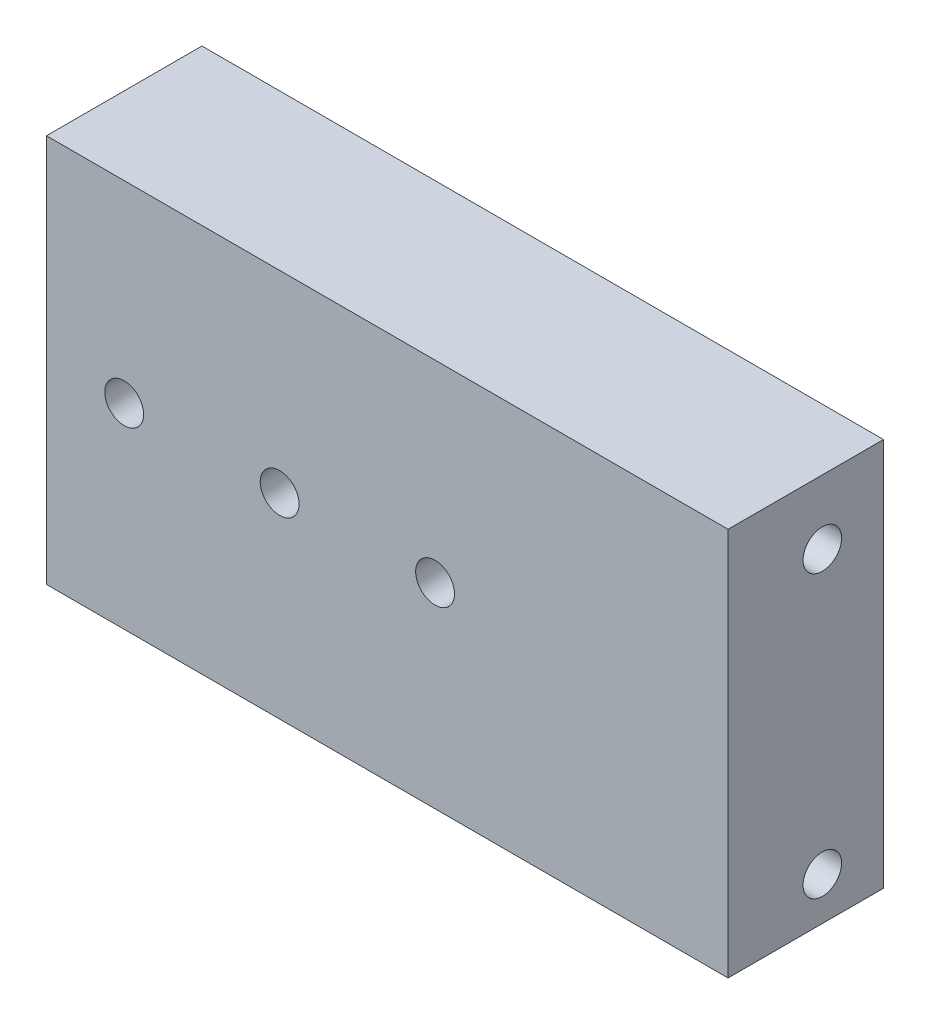
ISO-10303-21;
HEADER;
FILE_DESCRIPTION(('STEP AP214'),'2;1');
FILE_NAME('part.step','',(''),(''),'','','');
FILE_SCHEMA(('AUTOMOTIVE_DESIGN { 1 0 10303 214 1 1 1 1 }'));
ENDSEC;
DATA;
#1=APPLICATION_CONTEXT('core data for automotive mechanical design processes');
#2=APPLICATION_PROTOCOL_DEFINITION('international standard','automotive_design',2000,#1);
#3=PRODUCT_CONTEXT('',#1,'mechanical');
#4=PRODUCT('Part','Part','',(#3));
#5=PRODUCT_RELATED_PRODUCT_CATEGORY('part','',(#4));
#6=PRODUCT_DEFINITION_FORMATION('','',#4);
#7=PRODUCT_DEFINITION_CONTEXT('part definition',#1,'design');
#8=PRODUCT_DEFINITION('design','',#6,#7);
#9=PRODUCT_DEFINITION_SHAPE('','',#8);
#10=(LENGTH_UNIT() NAMED_UNIT(*) SI_UNIT(.MILLI.,.METRE.));
#11=(NAMED_UNIT(*) PLANE_ANGLE_UNIT() SI_UNIT($,.RADIAN.));
#12=(NAMED_UNIT(*) SI_UNIT($,.STERADIAN.) SOLID_ANGLE_UNIT());
#13=UNCERTAINTY_MEASURE_WITH_UNIT(LENGTH_MEASURE(1.E-05),#10,'distance_accuracy_value','');
#14=(GEOMETRIC_REPRESENTATION_CONTEXT(3) GLOBAL_UNCERTAINTY_ASSIGNED_CONTEXT((#13)) GLOBAL_UNIT_ASSIGNED_CONTEXT((#10,
#11,#12)) REPRESENTATION_CONTEXT('',''));
#15=CARTESIAN_POINT('',(0.,0.,0.));
#16=DIRECTION('',(0.,0.,1.));
#17=DIRECTION('',(1.,0.,0.));
#18=AXIS2_PLACEMENT_3D('',#15,#16,#17);
#19=CARTESIAN_POINT('',(-179.767553050374,63.5,0.));
#20=DIRECTION('',(0.,-1.,0.));
#21=DIRECTION('',(0.,0.,-1.));
#22=AXIS2_PLACEMENT_3D('',#19,#20,#21);
#23=PLANE('',#22);
#24=DIRECTION('',(0.,0.,-1.));
#25=VECTOR('',#24,1.);
#26=CARTESIAN_POINT('',(-111.375959999766,63.5,0.));
#27=LINE('',#26,#25);
#28=CARTESIAN_POINT('',(-111.375959999766,63.5,0.));
#29=VERTEX_POINT('',#28);
#30=CARTESIAN_POINT('',(-111.375959999766,63.5,-25.4));
#31=VERTEX_POINT('',#30);
#32=EDGE_CURVE('E11',#29,#31,#27,.T.);
#33=ORIENTED_EDGE('',*,*,#32,.F.);
#34=DIRECTION('',(1.,0.,0.));
#35=VECTOR('',#34,1.);
#36=CARTESIAN_POINT('',(-179.767553050374,63.5,0.));
#37=LINE('',#36,#35);
#38=CARTESIAN_POINT('',(0.,63.5,0.));
#39=VERTEX_POINT('',#38);
#40=EDGE_CURVE('E39',#29,#39,#37,.T.);
#41=ORIENTED_EDGE('',*,*,#40,.T.);
#42=DIRECTION('',(0.,0.,-1.));
#43=VECTOR('',#42,1.);
#44=CARTESIAN_POINT('',(0.,63.5,0.));
#45=LINE('',#44,#43);
#46=CARTESIAN_POINT('',(0.,63.5,-25.4));
#47=VERTEX_POINT('',#46);
#48=EDGE_CURVE('E95',#39,#47,#45,.T.);
#49=ORIENTED_EDGE('',*,*,#48,.T.);
#50=DIRECTION('',(1.,0.,0.));
#51=VECTOR('',#50,1.);
#52=CARTESIAN_POINT('',(-179.767553050374,63.5,-25.4));
#53=LINE('',#52,#51);
#54=EDGE_CURVE('E85',#31,#47,#53,.T.);
#55=ORIENTED_EDGE('',*,*,#54,.F.);
#56=EDGE_LOOP('',(#33,#41,#49,#55));
#57=FACE_BOUND('',#56,.T.);
#58=ADVANCED_FACE('F35',(#57),#23,.F.);
#59=CARTESIAN_POINT('',(-179.767553050374,0.,-25.4));
#60=DIRECTION('',(0.,0.,-1.));
#61=DIRECTION('',(-1.,0.,0.));
#62=AXIS2_PLACEMENT_3D('',#59,#60,#61);
#63=PLANE('',#62);
#64=CARTESIAN_POINT('',(-98.6759599997656,32.0000000000835,-25.4));
#65=DIRECTION('',(0.,0.,1.));
#66=DIRECTION('',(1.,0.,0.));
#67=AXIS2_PLACEMENT_3D('',#64,#65,#66);
#68=CIRCLE('',#67,3.175);
#69=CARTESIAN_POINT('',(-95.5009599997656,32.0000000000835,-25.4));
#70=VERTEX_POINT('',#69);
#71=EDGE_CURVE('E143',#70,#70,#68,.T.);
#72=ORIENTED_EDGE('',*,*,#71,.T.);
#73=EDGE_LOOP('',(#72));
#74=FACE_BOUND('',#73,.T.);
#75=CARTESIAN_POINT('',(-47.8759599997656,32.0000000000835,-25.4));
#76=DIRECTION('',(0.,0.,1.));
#77=DIRECTION('',(1.,0.,0.));
#78=AXIS2_PLACEMENT_3D('',#75,#76,#77);
#79=CIRCLE('',#78,3.175);
#80=CARTESIAN_POINT('',(-44.7009599997656,32.0000000000835,-25.4));
#81=VERTEX_POINT('',#80);
#82=EDGE_CURVE('E147',#81,#81,#79,.T.);
#83=ORIENTED_EDGE('',*,*,#82,.T.);
#84=EDGE_LOOP('',(#83));
#85=FACE_BOUND('',#84,.T.);
#86=CARTESIAN_POINT('',(-73.2759599997656,32.0000000000835,-25.4));
#87=DIRECTION('',(0.,0.,1.));
#88=DIRECTION('',(1.,0.,0.));
#89=AXIS2_PLACEMENT_3D('',#86,#87,#88);
#90=CIRCLE('',#89,3.175);
#91=CARTESIAN_POINT('',(-70.1009599997656,32.0000000000835,-25.4));
#92=VERTEX_POINT('',#91);
#93=EDGE_CURVE('E108',#92,#92,#90,.T.);
#94=ORIENTED_EDGE('',*,*,#93,.T.);
#95=EDGE_LOOP('',(#94));
#96=FACE_BOUND('',#95,.T.);
#97=DIRECTION('',(1.,0.,0.));
#98=VECTOR('',#97,1.);
#99=CARTESIAN_POINT('',(-179.767553050374,0.,-25.4));
#100=LINE('',#99,#98);
#101=CARTESIAN_POINT('',(-111.375959999766,0.,-25.4));
#102=VERTEX_POINT('',#101);
#103=CARTESIAN_POINT('',(0.,0.,-25.4));
#104=VERTEX_POINT('',#103);
#105=EDGE_CURVE('E113',#102,#104,#100,.T.);
#106=ORIENTED_EDGE('',*,*,#105,.F.);
#107=DIRECTION('',(0.,1.,0.));
#108=VECTOR('',#107,1.);
#109=CARTESIAN_POINT('',(-111.375959999766,0.,-25.4));
#110=LINE('',#109,#108);
#111=EDGE_CURVE('E91',#102,#31,#110,.T.);
#112=ORIENTED_EDGE('',*,*,#111,.T.);
#113=ORIENTED_EDGE('',*,*,#54,.T.);
#114=DIRECTION('',(0.,1.,0.));
#115=VECTOR('',#114,1.);
#116=CARTESIAN_POINT('',(0.,0.,-25.4));
#117=LINE('',#116,#115);
#118=EDGE_CURVE('E89',#104,#47,#117,.T.);
#119=ORIENTED_EDGE('',*,*,#118,.F.);
#120=EDGE_LOOP('',(#106,#112,#113,#119));
#121=FACE_BOUND('',#120,.T.);
#122=ADVANCED_FACE('F87',(#74,#85,#96,#121),#63,.T.);
#123=CARTESIAN_POINT('',(-179.767553050374,0.,0.));
#124=DIRECTION('',(0.,-1.,0.));
#125=DIRECTION('',(0.,0.,-1.));
#126=AXIS2_PLACEMENT_3D('',#123,#124,#125);
#127=PLANE('',#126);
#128=DIRECTION('',(1.,0.,0.));
#129=VECTOR('',#128,1.);
#130=CARTESIAN_POINT('',(-179.767553050374,0.,0.));
#131=LINE('',#130,#129);
#132=CARTESIAN_POINT('',(-111.375959999766,0.,0.));
#133=VERTEX_POINT('',#132);
#134=CARTESIAN_POINT('',(0.,0.,0.));
#135=VERTEX_POINT('',#134);
#136=EDGE_CURVE('E57',#133,#135,#131,.T.);
#137=ORIENTED_EDGE('',*,*,#136,.F.);
#138=DIRECTION('',(0.,0.,-1.));
#139=VECTOR('',#138,1.);
#140=CARTESIAN_POINT('',(-111.375959999766,0.,0.));
#141=LINE('',#140,#139);
#142=EDGE_CURVE('E92',#133,#102,#141,.T.);
#143=ORIENTED_EDGE('',*,*,#142,.T.);
#144=ORIENTED_EDGE('',*,*,#105,.T.);
#145=DIRECTION('',(0.,0.,-1.));
#146=VECTOR('',#145,1.);
#147=CARTESIAN_POINT('',(0.,0.,0.));
#148=LINE('',#147,#146);
#149=EDGE_CURVE('E101',#135,#104,#148,.T.);
#150=ORIENTED_EDGE('',*,*,#149,.F.);
#151=EDGE_LOOP('',(#137,#143,#144,#150));
#152=FACE_BOUND('',#151,.T.);
#153=ADVANCED_FACE('F116',(#152),#127,.T.);
#154=CARTESIAN_POINT('',(-179.767553050374,0.,0.));
#155=DIRECTION('',(0.,0.,-1.));
#156=DIRECTION('',(-1.,0.,0.));
#157=AXIS2_PLACEMENT_3D('',#154,#155,#156);
#158=PLANE('',#157);
#159=CARTESIAN_POINT('',(-98.6759599997656,32.0000000000835,0.));
#160=DIRECTION('',(0.,0.,1.));
#161=DIRECTION('',(1.,0.,0.));
#162=AXIS2_PLACEMENT_3D('',#159,#160,#161);
#163=CIRCLE('',#162,3.175);
#164=CARTESIAN_POINT('',(-95.5009599997656,32.0000000000835,0.));
#165=VERTEX_POINT('',#164);
#166=EDGE_CURVE('E161',#165,#165,#163,.T.);
#167=ORIENTED_EDGE('',*,*,#166,.F.);
#168=EDGE_LOOP('',(#167));
#169=FACE_BOUND('',#168,.T.);
#170=CARTESIAN_POINT('',(-47.8759599997656,32.0000000000835,0.));
#171=DIRECTION('',(0.,0.,1.));
#172=DIRECTION('',(1.,0.,0.));
#173=AXIS2_PLACEMENT_3D('',#170,#171,#172);
#174=CIRCLE('',#173,3.175);
#175=CARTESIAN_POINT('',(-44.7009599997656,32.0000000000835,0.));
#176=VERTEX_POINT('',#175);
#177=EDGE_CURVE('E155',#176,#176,#174,.T.);
#178=ORIENTED_EDGE('',*,*,#177,.F.);
#179=EDGE_LOOP('',(#178));
#180=FACE_BOUND('',#179,.T.);
#181=CARTESIAN_POINT('',(-73.2759599997656,32.0000000000835,0.));
#182=DIRECTION('',(0.,0.,1.));
#183=DIRECTION('',(1.,0.,0.));
#184=AXIS2_PLACEMENT_3D('',#181,#182,#183);
#185=CIRCLE('',#184,3.175);
#186=CARTESIAN_POINT('',(-70.1009599997656,32.0000000000835,0.));
#187=VERTEX_POINT('',#186);
#188=EDGE_CURVE('E151',#187,#187,#185,.T.);
#189=ORIENTED_EDGE('',*,*,#188,.F.);
#190=EDGE_LOOP('',(#189));
#191=FACE_BOUND('',#190,.T.);
#192=DIRECTION('',(0.,1.,0.));
#193=VECTOR('',#192,1.);
#194=CARTESIAN_POINT('',(-111.375959999766,0.,0.));
#195=LINE('',#194,#193);
#196=EDGE_CURVE('E44',#133,#29,#195,.T.);
#197=ORIENTED_EDGE('',*,*,#196,.F.);
#198=ORIENTED_EDGE('',*,*,#136,.T.);
#199=DIRECTION('',(0.,1.,0.));
#200=VECTOR('',#199,1.);
#201=CARTESIAN_POINT('',(0.,0.,0.));
#202=LINE('',#201,#200);
#203=EDGE_CURVE('E105',#135,#39,#202,.T.);
#204=ORIENTED_EDGE('',*,*,#203,.T.);
#205=ORIENTED_EDGE('',*,*,#40,.F.);
#206=EDGE_LOOP('',(#197,#198,#204,#205));
#207=FACE_BOUND('',#206,.T.);
#208=ADVANCED_FACE('F119',(#169,#180,#191,#207),#158,.F.);
#209=CARTESIAN_POINT('',(0.,0.,0.));
#210=DIRECTION('',(1.,0.,0.));
#211=DIRECTION('',(0.,0.,-1.));
#212=AXIS2_PLACEMENT_3D('',#209,#210,#211);
#213=PLANE('',#212);
#214=CARTESIAN_POINT('',(0.,6.99999999999935,-15.4000000000041));
#215=DIRECTION('',(1.,0.,0.));
#216=DIRECTION('',(0.,0.,-1.));
#217=AXIS2_PLACEMENT_3D('',#214,#215,#216);
#218=CIRCLE('',#217,3.15);
#219=CARTESIAN_POINT('',(0.,6.99999999999935,-18.5500000000041));
#220=VERTEX_POINT('',#219);
#221=EDGE_CURVE('E173',#220,#220,#218,.T.);
#222=ORIENTED_EDGE('',*,*,#221,.F.);
#223=EDGE_LOOP('',(#222));
#224=FACE_BOUND('',#223,.T.);
#225=CARTESIAN_POINT('',(0.,52.9999999999994,-15.4000000000041));
#226=DIRECTION('',(1.,0.,0.));
#227=DIRECTION('',(0.,0.,-1.));
#228=AXIS2_PLACEMENT_3D('',#225,#226,#227);
#229=CIRCLE('',#228,3.15);
#230=CARTESIAN_POINT('',(0.,52.9999999999994,-18.5500000000041));
#231=VERTEX_POINT('',#230);
#232=EDGE_CURVE('E167',#231,#231,#229,.T.);
#233=ORIENTED_EDGE('',*,*,#232,.F.);
#234=EDGE_LOOP('',(#233));
#235=FACE_BOUND('',#234,.T.);
#236=ORIENTED_EDGE('',*,*,#48,.F.);
#237=ORIENTED_EDGE('',*,*,#203,.F.);
#238=ORIENTED_EDGE('',*,*,#149,.T.);
#239=ORIENTED_EDGE('',*,*,#118,.T.);
#240=EDGE_LOOP('',(#236,#237,#238,#239));
#241=FACE_BOUND('',#240,.T.);
#242=ADVANCED_FACE('F99',(#224,#235,#241),#213,.T.);
#243=CARTESIAN_POINT('',(-111.375959999766,25.6754000000835,-922.863280000003));
#244=DIRECTION('',(-1.,0.,0.));
#245=DIRECTION('',(0.,0.,1.));
#246=AXIS2_PLACEMENT_3D('',#243,#244,#245);
#247=PLANE('',#246);
#248=ORIENTED_EDGE('',*,*,#196,.T.);
#249=ORIENTED_EDGE('',*,*,#32,.T.);
#250=ORIENTED_EDGE('',*,*,#111,.F.);
#251=ORIENTED_EDGE('',*,*,#142,.F.);
#252=EDGE_LOOP('',(#248,#249,#250,#251));
#253=FACE_BOUND('',#252,.T.);
#254=ADVANCED_FACE('F37',(#253),#247,.T.);
#255=CARTESIAN_POINT('',(-73.2759599997656,32.0000000000835,0.));
#256=DIRECTION('',(0.,0.,1.));
#257=DIRECTION('',(1.,0.,0.));
#258=AXIS2_PLACEMENT_3D('',#255,#256,#257);
#259=CYLINDRICAL_SURFACE('',#258,3.175);
#260=ORIENTED_EDGE('',*,*,#93,.F.);
#261=EDGE_LOOP('',(#260));
#262=FACE_BOUND('',#261,.T.);
#263=ORIENTED_EDGE('',*,*,#188,.T.);
#264=EDGE_LOOP('',(#263));
#265=FACE_BOUND('',#264,.T.);
#266=ADVANCED_FACE('F204',(#262,#265),#259,.F.);
#267=CARTESIAN_POINT('',(-47.8759599997656,32.0000000000835,0.));
#268=DIRECTION('',(0.,0.,1.));
#269=DIRECTION('',(1.,0.,0.));
#270=AXIS2_PLACEMENT_3D('',#267,#268,#269);
#271=CYLINDRICAL_SURFACE('',#270,3.175);
#272=ORIENTED_EDGE('',*,*,#82,.F.);
#273=EDGE_LOOP('',(#272));
#274=FACE_BOUND('',#273,.T.);
#275=ORIENTED_EDGE('',*,*,#177,.T.);
#276=EDGE_LOOP('',(#275));
#277=FACE_BOUND('',#276,.T.);
#278=ADVANCED_FACE('F200',(#274,#277),#271,.F.);
#279=CARTESIAN_POINT('',(-98.6759599997656,32.0000000000835,0.));
#280=DIRECTION('',(0.,0.,1.));
#281=DIRECTION('',(1.,0.,0.));
#282=AXIS2_PLACEMENT_3D('',#279,#280,#281);
#283=CYLINDRICAL_SURFACE('',#282,3.175);
#284=ORIENTED_EDGE('',*,*,#71,.F.);
#285=EDGE_LOOP('',(#284));
#286=FACE_BOUND('',#285,.T.);
#287=ORIENTED_EDGE('',*,*,#166,.T.);
#288=EDGE_LOOP('',(#287));
#289=FACE_BOUND('',#288,.T.);
#290=ADVANCED_FACE('F193',(#286,#289),#283,.F.);
#291=CARTESIAN_POINT('',(-9.0000074,52.9999999999994,-15.4000000000041));
#292=DIRECTION('',(1.,0.,0.));
#293=DIRECTION('',(0.,0.,-1.));
#294=AXIS2_PLACEMENT_3D('',#291,#292,#293);
#295=CONICAL_SURFACE('',#294,3.15,1.02974425867665);
#296=CARTESIAN_POINT('',(-10.8927183499368,52.9999999999994,-15.4000000000041));
#297=VERTEX_POINT('',#296);
#298=VERTEX_LOOP('',#297);
#299=FACE_BOUND('',#298,.T.);
#300=CARTESIAN_POINT('',(-9.0000074,52.9999999999994,-15.4000000000041));
#301=DIRECTION('',(1.,0.,0.));
#302=DIRECTION('',(0.,0.,-1.));
#303=AXIS2_PLACEMENT_3D('',#300,#301,#302);
#304=CIRCLE('',#303,3.15);
#305=CARTESIAN_POINT('',(-9.0000074,52.9999999999994,-18.5500000000041));
#306=VERTEX_POINT('',#305);
#307=EDGE_CURVE('E164',#306,#306,#304,.T.);
#308=ORIENTED_EDGE('',*,*,#307,.T.);
#309=EDGE_LOOP('',(#308));
#310=FACE_BOUND('',#309,.T.);
#311=ADVANCED_FACE('F184',(#299,#310),#295,.F.);
#312=CARTESIAN_POINT('',(0.,52.9999999999994,-15.4000000000041));
#313=DIRECTION('',(1.,0.,0.));
#314=DIRECTION('',(0.,0.,-1.));
#315=AXIS2_PLACEMENT_3D('',#312,#313,#314);
#316=CYLINDRICAL_SURFACE('',#315,3.15);
#317=ORIENTED_EDGE('',*,*,#307,.F.);
#318=EDGE_LOOP('',(#317));
#319=FACE_BOUND('',#318,.T.);
#320=ORIENTED_EDGE('',*,*,#232,.T.);
#321=EDGE_LOOP('',(#320));
#322=FACE_BOUND('',#321,.T.);
#323=ADVANCED_FACE('F181',(#319,#322),#316,.F.);
#324=CARTESIAN_POINT('',(-9.0000074,6.99999999999935,-15.4000000000041));
#325=DIRECTION('',(1.,0.,0.));
#326=DIRECTION('',(0.,0.,-1.));
#327=AXIS2_PLACEMENT_3D('',#324,#325,#326);
#328=CONICAL_SURFACE('',#327,3.15,1.02974425867665);
#329=CARTESIAN_POINT('',(-10.8927183499368,6.99999999999935,-15.4000000000041));
#330=VERTEX_POINT('',#329);
#331=VERTEX_LOOP('',#330);
#332=FACE_BOUND('',#331,.T.);
#333=CARTESIAN_POINT('',(-9.0000074,6.99999999999935,-15.4000000000041));
#334=DIRECTION('',(1.,0.,0.));
#335=DIRECTION('',(0.,0.,-1.));
#336=AXIS2_PLACEMENT_3D('',#333,#334,#335);
#337=CIRCLE('',#336,3.15);
#338=CARTESIAN_POINT('',(-9.0000074,6.99999999999935,-18.5500000000041));
#339=VERTEX_POINT('',#338);
#340=EDGE_CURVE('E170',#339,#339,#337,.T.);
#341=ORIENTED_EDGE('',*,*,#340,.T.);
#342=EDGE_LOOP('',(#341));
#343=FACE_BOUND('',#342,.T.);
#344=ADVANCED_FACE('F183',(#332,#343),#328,.F.);
#345=CARTESIAN_POINT('',(0.,6.99999999999935,-15.4000000000041));
#346=DIRECTION('',(1.,0.,0.));
#347=DIRECTION('',(0.,0.,-1.));
#348=AXIS2_PLACEMENT_3D('',#345,#346,#347);
#349=CYLINDRICAL_SURFACE('',#348,3.15);
#350=ORIENTED_EDGE('',*,*,#340,.F.);
#351=EDGE_LOOP('',(#350));
#352=FACE_BOUND('',#351,.T.);
#353=ORIENTED_EDGE('',*,*,#221,.T.);
#354=EDGE_LOOP('',(#353));
#355=FACE_BOUND('',#354,.T.);
#356=ADVANCED_FACE('F177',(#352,#355),#349,.F.);
#357=CLOSED_SHELL('',(#58,#122,#153,#208,#242,#254,#266,#278,#290,#311,#323,#344,#356));
#358=MANIFOLD_SOLID_BREP('B2',#357);
#359=ADVANCED_BREP_SHAPE_REPRESENTATION('',(#18,#358),#14);
#360=SHAPE_DEFINITION_REPRESENTATION(#9,#359);
ENDSEC;
END-ISO-10303-21;
